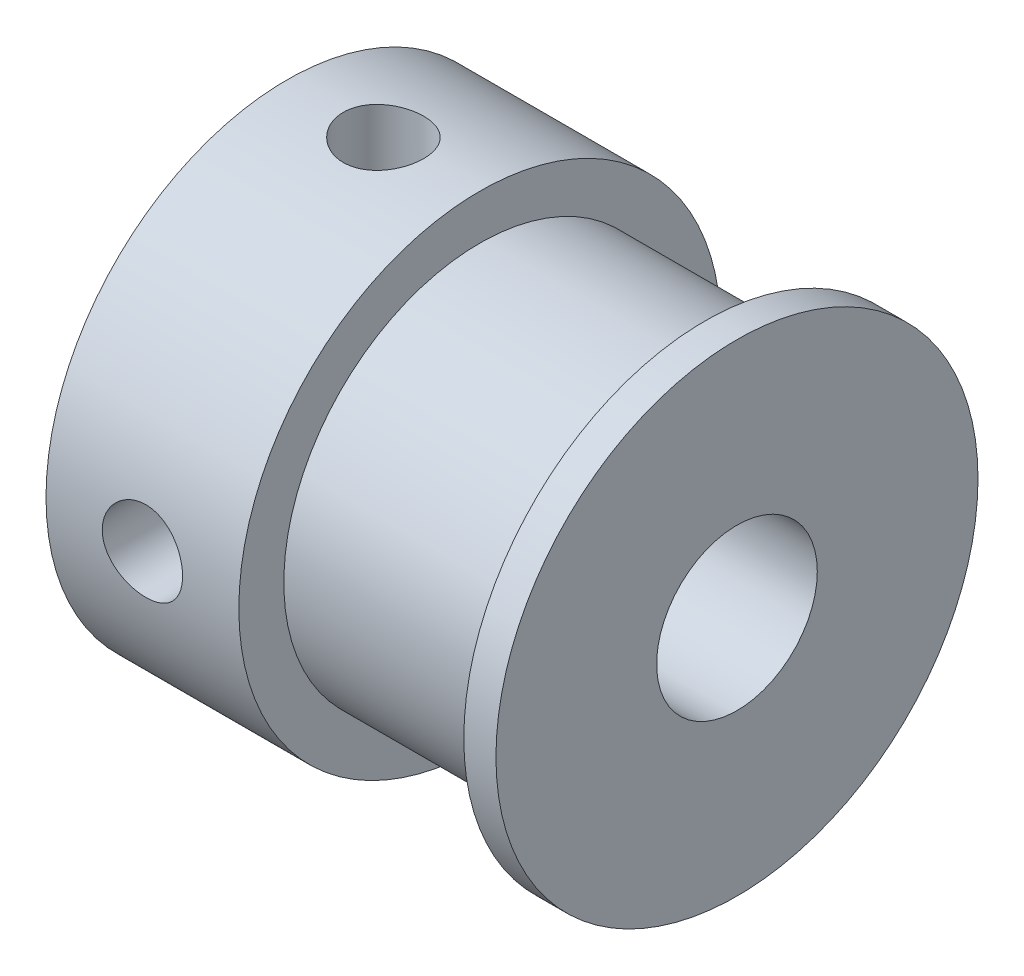
ISO-10303-21;
HEADER;
FILE_DESCRIPTION(('STEP AP214'),'2;1');
FILE_NAME('part.step','',(''),(''),'','','');
FILE_SCHEMA(('AUTOMOTIVE_DESIGN { 1 0 10303 214 1 1 1 1 }'));
ENDSEC;
DATA;
#1=APPLICATION_CONTEXT('core data for automotive mechanical design processes');
#2=APPLICATION_PROTOCOL_DEFINITION('international standard','automotive_design',2000,#1);
#3=PRODUCT_CONTEXT('',#1,'mechanical');
#4=PRODUCT('Part','Part','',(#3));
#5=PRODUCT_RELATED_PRODUCT_CATEGORY('part','',(#4));
#6=PRODUCT_DEFINITION_FORMATION('','',#4);
#7=PRODUCT_DEFINITION_CONTEXT('part definition',#1,'design');
#8=PRODUCT_DEFINITION('design','',#6,#7);
#9=PRODUCT_DEFINITION_SHAPE('','',#8);
#10=(LENGTH_UNIT() NAMED_UNIT(*) SI_UNIT(.MILLI.,.METRE.));
#11=(NAMED_UNIT(*) PLANE_ANGLE_UNIT() SI_UNIT($,.RADIAN.));
#12=(NAMED_UNIT(*) SI_UNIT($,.STERADIAN.) SOLID_ANGLE_UNIT());
#13=UNCERTAINTY_MEASURE_WITH_UNIT(LENGTH_MEASURE(1.E-05),#10,'distance_accuracy_value','');
#14=(GEOMETRIC_REPRESENTATION_CONTEXT(3) GLOBAL_UNCERTAINTY_ASSIGNED_CONTEXT((#13)) GLOBAL_UNIT_ASSIGNED_CONTEXT((#10,
#11,#12)) REPRESENTATION_CONTEXT('',''));
#15=CARTESIAN_POINT('',(0.,0.,0.));
#16=DIRECTION('',(0.,0.,1.));
#17=DIRECTION('',(1.,0.,0.));
#18=AXIS2_PLACEMENT_3D('',#15,#16,#17);
#19=CARTESIAN_POINT('',(0.,0.,0.));
#20=DIRECTION('',(1.,0.,0.));
#21=DIRECTION('',(0.,0.,-1.));
#22=AXIS2_PLACEMENT_3D('',#19,#20,#21);
#23=CYLINDRICAL_SURFACE('',#22,2.5);
#24=CARTESIAN_POINT('',(1.75000000000001,0.,2.5));
#25=CARTESIAN_POINT('',(1.75000412789938,0.0657149536912327,2.49999641755189));
#26=CARTESIAN_POINT('',(1.7552125914021,0.13150824962254,2.49738113774397));
#27=CARTESIAN_POINT('',(1.77581610042615,0.26115029408553,2.48717695046745));
#28=CARTESIAN_POINT('',(1.79123049124707,0.324995108391878,2.4795785978623));
#29=CARTESIAN_POINT('',(1.831492260771,0.448666931100716,2.4602034925414));
#30=CARTESIAN_POINT('',(1.85630298031002,0.508508503673972,2.448442989719));
#31=CARTESIAN_POINT('',(1.91446327670618,0.623090771008203,2.42182220644723));
#32=CARTESIAN_POINT('',(1.94781218031107,0.677831867487559,2.40696217041913));
#33=CARTESIAN_POINT('',(2.02439656185663,0.784384772202394,2.37445322822571));
#34=CARTESIAN_POINT('',(2.06810809904956,0.835819013902635,2.3566899890942));
#35=CARTESIAN_POINT('',(2.1631518490588,0.930974306083716,2.32074962808431));
#36=CARTESIAN_POINT('',(2.21448981471555,0.974689478883452,2.30257220261294));
#37=CARTESIAN_POINT('',(2.32810418690423,1.05656500056284,2.26623688996684));
#38=CARTESIAN_POINT('',(2.39092012293239,1.09403166943954,2.24818983712665));
#39=CARTESIAN_POINT('',(2.52295916998277,1.15771028361336,2.21607473465401));
#40=CARTESIAN_POINT('',(2.59217766090344,1.18393026870791,2.20200384508737));
#41=CARTESIAN_POINT('',(2.73083138177741,1.22266555273573,2.18072333797261));
#42=CARTESIAN_POINT('',(2.80000556508424,1.23590732135054,2.17315339479642));
#43=CARTESIAN_POINT('',(2.93997354722435,1.25053374163605,2.1647736243566));
#44=CARTESIAN_POINT('',(3.01076567608894,1.25193011046634,2.16395711679111));
#45=CARTESIAN_POINT('',(3.14285753039421,1.24335910896536,2.16888662821561));
#46=CARTESIAN_POINT('',(3.20428003902881,1.23473069942102,2.17385954577517));
#47=CARTESIAN_POINT('',(3.3246523867163,1.20867481132116,2.18845285917313));
#48=CARTESIAN_POINT('',(3.38360143163164,1.19124452987206,2.19807473539721));
#49=CARTESIAN_POINT('',(3.49903641570707,1.1477622254825,2.22109345515927));
#50=CARTESIAN_POINT('',(3.55543299848223,1.12151883389499,2.23457300829999));
#51=CARTESIAN_POINT('',(3.66329286573751,1.061302109585,2.26379255351755));
#52=CARTESIAN_POINT('',(3.71475391950011,1.02732530476558,2.27953355975239));
#53=CARTESIAN_POINT('',(3.81815156592903,0.94758256864098,2.31391447379108));
#54=CARTESIAN_POINT('',(3.86932109197019,0.900868072961596,2.33266887795933));
#55=CARTESIAN_POINT('',(3.96341927323862,0.799444473426712,2.36934529125509));
#56=CARTESIAN_POINT('',(4.00634399004235,0.744731570717852,2.38726689948501));
#57=CARTESIAN_POINT('',(4.08460707628715,0.625645632289807,2.42127484103705));
#58=CARTESIAN_POINT('',(4.11950059055717,0.560941989499257,2.43723730202509));
#59=CARTESIAN_POINT('',(4.17762128630375,0.425582769360993,2.46447351401553));
#60=CARTESIAN_POINT('',(4.20085773126895,0.354931970331593,2.47575098679441));
#61=CARTESIAN_POINT('',(4.23309425464584,0.215958114575875,2.49155417176795));
#62=CARTESIAN_POINT('',(4.24311404468347,0.147926913185404,2.4965617287664));
#63=CARTESIAN_POINT('',(4.2518309139181,0.0109744999366913,2.50091266823877));
#64=CARTESIAN_POINT('',(4.25053335704934,-0.057946274837377,2.5002587340164));
#65=CARTESIAN_POINT('',(4.23724163947655,-0.189041214982492,2.49363990316801));
#66=CARTESIAN_POINT('',(4.22608433408745,-0.251324260062442,2.48809057110237));
#67=CARTESIAN_POINT('',(4.19470241013114,-0.373008615377395,2.47277714143524));
#68=CARTESIAN_POINT('',(4.1744767919333,-0.432409607113745,2.46301257917916));
#69=CARTESIAN_POINT('',(4.12500191695853,-0.548610760562079,2.43980314267087));
#70=CARTESIAN_POINT('',(4.09551118735398,-0.605287996257689,2.42626102212424));
#71=CARTESIAN_POINT('',(4.02861558044244,-0.713076702123648,2.39679967896386));
#72=CARTESIAN_POINT('',(3.9912073317582,-0.764185787219099,2.38087944457232));
#73=CARTESIAN_POINT('',(3.9052994683339,-0.864709611613313,2.34635276671831));
#74=CARTESIAN_POINT('',(3.85607141443304,-0.913465097280795,2.32763606060552));
#75=CARTESIAN_POINT('',(3.75009356091336,-1.00232040139154,2.29077989504843));
#76=CARTESIAN_POINT('',(3.69333860147953,-1.04241423211355,2.27264084226908));
#77=CARTESIAN_POINT('',(3.57044543224961,-1.11463489312211,2.23813990282585));
#78=CARTESIAN_POINT('',(3.50398591723925,-1.14628186984829,2.2219066207934));
#79=CARTESIAN_POINT('',(3.36561241538434,-1.19760353251725,2.19467590460158));
#80=CARTESIAN_POINT('',(3.29370559187351,-1.21729364485946,2.18367172800773));
#81=CARTESIAN_POINT('',(3.15386222142319,-1.24232710931209,2.16951876260834));
#82=CARTESIAN_POINT('',(3.0862071832137,-1.24886624550107,2.16571729325614));
#83=CARTESIAN_POINT('',(2.95069116603659,-1.25086144297598,2.16456693307719));
#84=CARTESIAN_POINT('',(2.88283028907571,-1.24632230828049,2.16721524534441));
#85=CARTESIAN_POINT('',(2.75564562308498,-1.22740765699032,2.17797327562531));
#86=CARTESIAN_POINT('',(2.6961244123195,-1.21401039292849,2.18553868102992));
#87=CARTESIAN_POINT('',(2.58023985071912,-1.1789691977808,2.20463770234897));
#88=CARTESIAN_POINT('',(2.52387752238504,-1.15732261394975,2.21617259462095));
#89=CARTESIAN_POINT('',(2.41171893626674,-1.10476968162585,2.2428566295566));
#90=CARTESIAN_POINT('',(2.35621512271288,-1.07333892227057,2.25819652995239));
#91=CARTESIAN_POINT('',(2.25090682977427,-1.00268871454579,2.29044164543238));
#92=CARTESIAN_POINT('',(2.20110533685189,-0.963465214048303,2.30734767243153));
#93=CARTESIAN_POINT('',(2.10232252205298,-0.872754158330795,2.34327903949142));
#94=CARTESIAN_POINT('',(2.0541761220476,-0.820355528762707,2.36231229139336));
#95=CARTESIAN_POINT('',(1.96717127072046,-0.707693507775343,2.3984719031886));
#96=CARTESIAN_POINT('',(1.92831782571714,-0.647425904070975,2.4155972326005));
#97=CARTESIAN_POINT('',(1.86095454654725,-0.519914496024928,2.44622511981379));
#98=CARTESIAN_POINT('',(1.83251978823571,-0.452624379918263,2.45970120703636));
#99=CARTESIAN_POINT('',(1.78773979010132,-0.313427626617735,2.48126676704332));
#100=CARTESIAN_POINT('',(1.77136019146303,-0.241534749528953,2.48937154216165));
#101=CARTESIAN_POINT('',(1.7576282361552,-0.140752433104227,2.49619327387079));
#102=CARTESIAN_POINT('',(1.75477169892048,-0.112702349299371,2.49761706674002));
#103=CARTESIAN_POINT('',(1.750956668104,-0.0564396647589458,2.49952121222331));
#104=CARTESIAN_POINT('',(1.74999822691101,-0.0282270595592261,2.50000153879704));
#105=CARTESIAN_POINT('',(1.75000000000001,0.,2.5));
#106=B_SPLINE_CURVE_WITH_KNOTS('',3,(#24,#25,#26,#27,#28,#29,#30,#31,#32,#33,#34,#35,#36,#37,
#38,#39,#40,#41,#42,#43,#44,#45,#46,#47,#48,#49,#50,#51,#52,#53,#54,#55,#56,#57,#58,#59,#60,#61,
#62,#63,#64,#65,#66,#67,#68,#69,#70,#71,#72,#73,#74,#75,#76,#77,#78,#79,#80,#81,#82,#83,#84,#85,
#86,#87,#88,#89,#90,#91,#92,#93,#94,#95,#96,#97,#98,#99,#100,#101,#102,#103,#104,#105),
.UNSPECIFIED.,.T.,.F.,(4,2,2,2,2,2,2,2,2,2,2,2,2,2,2,2,2,2,2,2,2,2,2,2,2,2,2,2,2,2,2,2,2,2,2,2,
2,2,2,2,4),(0.,0.197030321775364,0.394435187136495,0.59107769436537,0.787704700726955,
0.996227198397605,1.20490779706754,1.4297715803844,1.6544743487285,1.86572515175286,
2.07676696661274,2.26257140511649,2.44843504907097,2.63862800210608,2.82890651575276,
3.04331176667346,3.25781918248356,3.48228777768049,3.70657771140347,3.9122911308918,
4.11790705639343,4.3075863313265,4.49728652038662,4.69241070034871,4.88761813435421,
5.10199513305521,5.31651985769287,5.54143352699589,5.76605639925969,5.96911634372963,
6.17208824825003,6.35572412805225,6.53941910979594,6.73545570969514,6.93159451423693,
7.15156553440619,7.37165479220712,7.59330017078652,7.81431135781158,7.89894100172117,
7.98357298143554),.UNSPECIFIED.);
#107=CARTESIAN_POINT('',(1.75000000000001,0.,2.5));
#108=VERTEX_POINT('',#107);
#109=EDGE_CURVE('E81',#108,#108,#106,.T.);
#110=ORIENTED_EDGE('',*,*,#109,.F.);
#111=EDGE_LOOP('',(#110));
#112=FACE_BOUND('',#111,.T.);
#113=CARTESIAN_POINT('',(3.,2.1650635094611,-1.25));
#114=CARTESIAN_POINT('',(3.06513476024406,2.16506918410574,-1.24999545384316));
#115=CARTESIAN_POINT('',(3.13035176440631,2.16804751484696,-1.24487496341652));
#116=CARTESIAN_POINT('',(3.25878408084644,2.17952958065066,-1.22465401237257));
#117=CARTESIAN_POINT('',(3.32199489380426,2.18804492569449,-1.20953258069272));
#118=CARTESIAN_POINT('',(3.44431458042993,2.20936683256748,-1.17012493587476));
#119=CARTESIAN_POINT('',(3.50344331559198,2.22215054341565,-1.14588744061716));
#120=CARTESIAN_POINT('',(3.6167802524959,2.25053331021072,-1.08908440672046));
#121=CARTESIAN_POINT('',(3.67098818782807,2.26613251845081,-1.05651841754472));
#122=CARTESIAN_POINT('',(3.77788216069688,2.29996086321802,-0.980833175663598));
#123=CARTESIAN_POINT('',(3.83007391959193,2.31830079547442,-0.937065045179713));
#124=CARTESIAN_POINT('',(3.92676048550839,2.35464978482132,-0.841567259518085));
#125=CARTESIAN_POINT('',(3.9712514532294,2.37265867289062,-0.789833657227866));
#126=CARTESIAN_POINT('',(4.05420893893458,2.40776846191186,-0.675611954268182));
#127=CARTESIAN_POINT('',(4.09206720982441,2.42472633022716,-0.612633986265718));
#128=CARTESIAN_POINT('',(4.1564260665572,2.45438445124411,-0.48019628324938));
#129=CARTESIAN_POINT('',(4.18293382017146,2.46708738979677,-0.410740672672694));
#130=CARTESIAN_POINT('',(4.22188082662637,2.48600576555297,-0.272556179907471));
#131=CARTESIAN_POINT('',(4.23518690794442,2.49261850276115,-0.204127238111022));
#132=CARTESIAN_POINT('',(4.2502076483438,2.50009479807584,-0.0657132858723104));
#133=CARTESIAN_POINT('',(4.25192932099464,2.50096183480737,0.00427075730467264));
#134=CARTESIAN_POINT('',(4.24406665753706,2.49703727395563,0.137290655529687));
#135=CARTESIAN_POINT('',(4.23545248059847,2.49273119865201,0.200401498970989));
#136=CARTESIAN_POINT('',(4.20889894511918,2.47967806574684,0.324142214897902));
#137=CARTESIAN_POINT('',(4.19095888877972,2.47093067582992,0.384771901367406));
#138=CARTESIAN_POINT('',(4.14614679238773,2.44964479109568,0.502886739461942));
#139=CARTESIAN_POINT('',(4.11915460853491,2.43705551911499,0.560316779393972));
#140=CARTESIAN_POINT('',(4.05717072974813,2.40922057483359,0.66997100189166));
#141=CARTESIAN_POINT('',(4.02217617087206,2.39397395196855,0.722193311048307));
#142=CARTESIAN_POINT('',(3.94138081058373,2.36055492999037,0.825217076122743));
#143=CARTESIAN_POINT('',(3.89487121459249,2.34224219997719,0.8754175937867));
#144=CARTESIAN_POINT('',(3.79426284383728,2.30567925733515,0.967630462872225));
#145=CARTESIAN_POINT('',(3.74015828465742,2.28742910332036,1.00963651446779));
#146=CARTESIAN_POINT('',(3.62168975946989,2.25180195115606,1.08688166830276));
#147=CARTESIAN_POINT('',(3.55689247118223,2.23455399988385,1.12152164372256));
#148=CARTESIAN_POINT('',(3.42132791080125,2.2046931284822,1.17914889125154));
#149=CARTESIAN_POINT('',(3.35056695872805,2.19207537557584,1.20214832276361));
#150=CARTESIAN_POINT('',(3.21098186089651,2.17430794771293,1.2339752637813));
#151=CARTESIAN_POINT('',(3.14244860119556,2.16864569810621,1.24378140264997));
#152=CARTESIAN_POINT('',(3.00449832310432,2.16397399202012,1.25189618326428));
#153=CARTESIAN_POINT('',(2.93508196360027,2.1649598361164,1.25021294664378));
#154=CARTESIAN_POINT('',(2.80543260177659,2.17292920675731,1.23629505417996));
#155=CARTESIAN_POINT('',(2.74502568611509,2.17924484383318,1.22523477089058));
#156=CARTESIAN_POINT('',(2.6270402671613,2.19617526939176,1.19462035579055));
#157=CARTESIAN_POINT('',(2.56946268656674,2.20679145006292,1.17506347327952));
#158=CARTESIAN_POINT('',(2.45573583637163,2.23170277599571,1.12705948575611));
#159=CARTESIAN_POINT('',(2.39977622893306,2.24614554053829,1.0982425796159));
#160=CARTESIAN_POINT('',(2.29316341057626,2.27695149371562,1.03285883001975));
#161=CARTESIAN_POINT('',(2.2425129456084,2.29331566693935,0.99628800541527));
#162=CARTESIAN_POINT('',(2.14127654059557,2.3285999807042,0.911046458998566));
#163=CARTESIAN_POINT('',(2.09150356160293,2.34758228942861,0.861431590393708));
#164=CARTESIAN_POINT('',(2.00073470250801,2.38417793722366,0.75425561924786));
#165=CARTESIAN_POINT('',(1.95974178721183,2.40179081259637,0.696691843319183));
#166=CARTESIAN_POINT('',(1.88678284256237,2.43426702113696,0.573169203198446));
#167=CARTESIAN_POINT('',(1.85508360223636,2.44904552090037,0.507028871967641));
#168=CARTESIAN_POINT('',(1.80357762017826,2.47354193699126,0.369402955801352));
#169=CARTESIAN_POINT('',(1.78376043579212,2.48326429595466,0.29792212674022));
#170=CARTESIAN_POINT('',(1.75828929478167,2.49584385227353,0.158724602913021));
#171=CARTESIAN_POINT('',(1.75150265515486,2.49924909885239,0.0912643048130715));
#172=CARTESIAN_POINT('',(1.748945918182,2.50052662968914,-0.0439074824390041));
#173=CARTESIAN_POINT('',(1.75317196434555,2.49840085083612,-0.111618875368858));
#174=CARTESIAN_POINT('',(1.77177050849453,2.48917461047403,-0.240672490396433));
#175=CARTESIAN_POINT('',(1.78545606157209,2.48241118334987,-0.302140397264079));
#176=CARTESIAN_POINT('',(1.82165874912871,2.46490117079279,-0.421807440229521));
#177=CARTESIAN_POINT('',(1.84417715011682,2.45415401415995,-0.480006106194385));
#178=CARTESIAN_POINT('',(1.89840881520747,2.4290741343515,-0.594279257806105));
#179=CARTESIAN_POINT('',(1.9304741540098,2.41460771498499,-0.650156428375057));
#180=CARTESIAN_POINT('',(2.00244741357381,2.38360166427283,-0.75596830226753));
#181=CARTESIAN_POINT('',(2.04235893639459,2.36706108197951,-0.805900259268633));
#182=CARTESIAN_POINT('',(2.13349642377838,2.33160762783285,-0.903642505196113));
#183=CARTESIAN_POINT('',(2.18545310934649,2.31262248764622,-0.950747105674089));
#184=CARTESIAN_POINT('',(2.29681340141221,2.27578845203566,-1.03582910924334));
#185=CARTESIAN_POINT('',(2.35622352608461,2.25794057202332,-1.07379843751257));
#186=CARTESIAN_POINT('',(2.48329580822619,2.22499506631145,-1.14053884973207));
#187=CARTESIAN_POINT('',(2.55115941391092,2.21000217820338,-1.16898133245117));
#188=CARTESIAN_POINT('',(2.69166550542472,2.1858269541044,-1.21359838688301));
#189=CARTESIAN_POINT('',(2.76429111114086,2.17662520184628,-1.22981398896918));
#190=CARTESIAN_POINT('',(2.864756694565,2.16911590752238,-1.24295875983052));
#191=CARTESIAN_POINT('',(2.89170986799735,2.1676016125644,-1.24559513120481));
#192=CARTESIAN_POINT('',(2.9457706008528,2.16557419859688,-1.24911675636245));
#193=CARTESIAN_POINT('',(2.97287817048234,2.16506114656387,-1.25000189299984));
#194=CARTESIAN_POINT('',(3.,2.1650635094611,-1.25));
#195=B_SPLINE_CURVE_WITH_KNOTS('',3,(#113,#114,#115,#116,#117,#118,#119,#120,#121,#122,#123,
#124,#125,#126,#127,#128,#129,#130,#131,#132,#133,#134,#135,#136,#137,#138,#139,#140,#141,#142,
#143,#144,#145,#146,#147,#148,#149,#150,#151,#152,#153,#154,#155,#156,#157,#158,#159,#160,#161,
#162,#163,#164,#165,#166,#167,#168,#169,#170,#171,#172,#173,#174,#175,#176,#177,#178,#179,#180,
#181,#182,#183,#184,#185,#186,#187,#188,#189,#190,#191,#192,#193,#194),.UNSPECIFIED.,.T.,.F.,(4,
2,2,2,2,2,2,2,2,2,2,2,2,2,2,2,2,2,2,2,2,2,2,2,2,2,2,2,2,2,2,2,2,2,2,2,2,2,2,2,4),(0.,
0.195290153243394,0.390991116031005,0.585660744898606,0.780340906806436,0.99107789062279,
1.20191963855464,1.42697365298454,1.65188533704864,1.86079356209919,2.0695752960755,
2.26020121855673,2.45084140646819,2.64411918413933,2.8374662418784,3.04908989321113,
3.26087560307398,3.4861105216181,3.71110967764631,3.91827863567764,4.12530116485466,
4.30967729280032,4.49411315545078,4.68709120507609,4.88016857775059,5.09758429475766,
5.31507331222752,5.53830226766207,5.76133474760964,5.96390337986858,6.16640108492464,
6.35555531089365,6.54473666890016,6.74200938399339,6.93937287625898,7.15637802312584,
7.37357428556442,7.59763436298256,7.8209391625345,7.90225168981636,7.98356965618175),.UNSPECIFIED.);
#196=CARTESIAN_POINT('',(3.,2.1650635094611,-1.25));
#197=VERTEX_POINT('',#196);
#198=EDGE_CURVE('E73',#197,#197,#195,.T.);
#199=ORIENTED_EDGE('',*,*,#198,.F.);
#200=EDGE_LOOP('',(#199));
#201=FACE_BOUND('',#200,.T.);
#202=CARTESIAN_POINT('',(14.,0.,0.));
#203=DIRECTION('',(1.,0.,0.));
#204=DIRECTION('',(0.,0.,-1.));
#205=AXIS2_PLACEMENT_3D('',#202,#203,#204);
#206=CIRCLE('',#205,2.5);
#207=CARTESIAN_POINT('',(14.,0.,-2.5));
#208=VERTEX_POINT('',#207);
#209=EDGE_CURVE('E80',#208,#208,#206,.T.);
#210=ORIENTED_EDGE('',*,*,#209,.T.);
#211=EDGE_LOOP('',(#210));
#212=FACE_BOUND('',#211,.T.);
#213=CARTESIAN_POINT('',(0.,0.,0.));
#214=DIRECTION('',(1.,0.,0.));
#215=DIRECTION('',(0.,0.,-1.));
#216=AXIS2_PLACEMENT_3D('',#213,#214,#215);
#217=CIRCLE('',#216,2.5);
#218=CARTESIAN_POINT('',(0.,0.,-2.5));
#219=VERTEX_POINT('',#218);
#220=EDGE_CURVE('E48',#219,#219,#217,.T.);
#221=ORIENTED_EDGE('',*,*,#220,.F.);
#222=EDGE_LOOP('',(#221));
#223=FACE_BOUND('',#222,.T.);
#224=ADVANCED_FACE('F32',(#112,#201,#212,#223),#23,.F.);
#225=CARTESIAN_POINT('',(0.,2.5,0.));
#226=DIRECTION('',(-1.,0.,0.));
#227=DIRECTION('',(0.,0.,1.));
#228=AXIS2_PLACEMENT_3D('',#225,#226,#227);
#229=PLANE('',#228);
#230=ORIENTED_EDGE('',*,*,#220,.T.);
#231=EDGE_LOOP('',(#230));
#232=FACE_BOUND('',#231,.T.);
#233=CARTESIAN_POINT('',(0.,0.,0.));
#234=DIRECTION('',(1.,0.,0.));
#235=DIRECTION('',(0.,0.,-1.));
#236=AXIS2_PLACEMENT_3D('',#233,#234,#235);
#237=CIRCLE('',#236,7.5);
#238=CARTESIAN_POINT('',(0.,0.,-7.5));
#239=VERTEX_POINT('',#238);
#240=EDGE_CURVE('E52',#239,#239,#237,.T.);
#241=ORIENTED_EDGE('',*,*,#240,.F.);
#242=EDGE_LOOP('',(#241));
#243=FACE_BOUND('',#242,.T.);
#244=ADVANCED_FACE('F106',(#232,#243),#229,.T.);
#245=CARTESIAN_POINT('',(0.,0.,0.));
#246=DIRECTION('',(1.,0.,0.));
#247=DIRECTION('',(0.,0.,-1.));
#248=AXIS2_PLACEMENT_3D('',#245,#246,#247);
#249=CYLINDRICAL_SURFACE('',#248,7.5);
#250=CARTESIAN_POINT('',(1.75000000000001,0.,7.5));
#251=CARTESIAN_POINT('',(1.75000279447392,-0.069695452479107,7.49999880584412));
#252=CARTESIAN_POINT('',(1.75584863748447,-0.13942894091941,7.49901838956517));
#253=CARTESIAN_POINT('',(1.77906782938267,-0.27694011083652,7.49520172470694));
#254=CARTESIAN_POINT('',(1.79645177845581,-0.344715933979622,7.49236376961945));
#255=CARTESIAN_POINT('',(1.84220772429638,-0.476302373606319,7.48515034118225));
#256=CARTESIAN_POINT('',(1.87057073282029,-0.540116184215947,7.48077612579597));
#257=CARTESIAN_POINT('',(1.9374561460262,-0.662070920988969,7.47097113541035));
#258=CARTESIAN_POINT('',(1.9759773887415,-0.720212494939292,7.46554048127217));
#259=CARTESIAN_POINT('',(2.06247754191024,-0.829736307145835,7.45416658729157));
#260=CARTESIAN_POINT('',(2.11053455731807,-0.881056451767479,7.44821935907428));
#261=CARTESIAN_POINT('',(2.21457398423641,-0.974944249329958,7.43651313438366));
#262=CARTESIAN_POINT('',(2.27055689572831,-1.01751134969548,7.43075414981334));
#263=CARTESIAN_POINT('',(2.38928548309853,-1.09293356280256,7.4200378287989));
#264=CARTESIAN_POINT('',(2.45207066840238,-1.12572727643049,7.41508564545818));
#265=CARTESIAN_POINT('',(2.58235478215032,-1.1802791827056,7.40659894897337));
#266=CARTESIAN_POINT('',(2.64985339183882,-1.2020381207828,7.40306434007154));
#267=CARTESIAN_POINT('',(2.78699013742827,-1.2337071888924,7.39785268421378));
#268=CARTESIAN_POINT('',(2.8566028682507,-1.24372451456769,7.3961588424285));
#269=CARTESIAN_POINT('',(2.99654013844174,-1.25195836264493,7.39476969468325));
#270=CARTESIAN_POINT('',(3.06686462708365,-1.25017572019449,7.39507424728607));
#271=CARTESIAN_POINT('',(3.20546393063772,-1.23494754919807,7.39763214431778));
#272=CARTESIAN_POINT('',(3.27375240177262,-1.22162244094488,7.39986536659458));
#273=CARTESIAN_POINT('',(3.40711065891456,-1.18387657020172,7.40599747605504));
#274=CARTESIAN_POINT('',(3.47218033444427,-1.15945542715986,7.40989642036636));
#275=CARTESIAN_POINT('',(3.59761441172046,-1.10008862304695,7.4189423966705));
#276=CARTESIAN_POINT('',(3.65795470304061,-1.06509295693985,7.42409533553663));
#277=CARTESIAN_POINT('',(3.77195220026919,-0.985606008778711,7.43506459207505));
#278=CARTESIAN_POINT('',(3.82560886622746,-0.941113960327138,7.44088096327143));
#279=CARTESIAN_POINT('',(3.92541304290367,-0.843241106079522,7.45261013939893));
#280=CARTESIAN_POINT('',(3.97145925927004,-0.789756981936559,7.45852324615826));
#281=CARTESIAN_POINT('',(4.05393888133267,-0.675767624490819,7.46971300698362));
#282=CARTESIAN_POINT('',(4.09037222509161,-0.615262345953207,7.47498965694873));
#283=CARTESIAN_POINT('',(4.15260111356814,-0.488852958083352,7.48431946446456));
#284=CARTESIAN_POINT('',(4.17838770966562,-0.422944362782327,7.48837159203724));
#285=CARTESIAN_POINT('',(4.21849710762298,-0.287649172801363,7.4947875150633));
#286=CARTESIAN_POINT('',(4.23282086848685,-0.218262869589732,7.49715145175237));
#287=CARTESIAN_POINT('',(4.24946067923056,-0.0788549506508106,7.49990564921343));
#288=CARTESIAN_POINT('',(4.2519157859028,-0.0088503685755048,7.50031876506392));
#289=CARTESIAN_POINT('',(4.24511932778593,0.130569886444944,7.49918737210585));
#290=CARTESIAN_POINT('',(4.23586821343312,0.199985581946019,7.49764293862059));
#291=CARTESIAN_POINT('',(4.20603757533225,0.33582808777338,7.49278413469101));
#292=CARTESIAN_POINT('',(4.18552689580493,0.402270434192688,7.48948052400655));
#293=CARTESIAN_POINT('',(4.13383274090023,0.530773442430219,7.48147232227679));
#294=CARTESIAN_POINT('',(4.10264866618236,0.592833857954856,7.4767676525601));
#295=CARTESIAN_POINT('',(4.0301744376516,0.711415344734475,7.46642258151204));
#296=CARTESIAN_POINT('',(3.98879742191637,0.76788262546857,7.46077427943511));
#297=CARTESIAN_POINT('',(3.89723134230746,0.873121792751339,7.4491923369595));
#298=CARTESIAN_POINT('',(3.84704163836166,0.921893119848286,7.44325867585773));
#299=CARTESIAN_POINT('',(3.73865122596428,1.01087138982899,7.43170087617923));
#300=CARTESIAN_POINT('',(3.68037291724279,1.05098438055685,7.42608058068553));
#301=CARTESIAN_POINT('',(3.55782351543073,1.12085115514749,7.41585764888942));
#302=CARTESIAN_POINT('',(3.49355261238625,1.1506052673849,7.4112549803301));
#303=CARTESIAN_POINT('',(3.36110513359393,1.19876916573657,7.40361726848852));
#304=CARTESIAN_POINT('',(3.29294595248475,1.21722571627397,7.40057577155532));
#305=CARTESIAN_POINT('',(3.15443993538912,1.24241772688913,7.3963885841763));
#306=CARTESIAN_POINT('',(3.08409329013397,1.24915420597308,7.39524272891361));
#307=CARTESIAN_POINT('',(2.9441474170188,1.25068643302367,7.39498366542006));
#308=CARTESIAN_POINT('',(2.87454981071236,1.24563006806259,7.39584528252825));
#309=CARTESIAN_POINT('',(2.73721037597462,1.22403991947842,7.39944890726864));
#310=CARTESIAN_POINT('',(2.66946854152907,1.20750617305623,7.40219090880607));
#311=CARTESIAN_POINT('',(2.5378207813537,1.16348724479744,7.40923678140859));
#312=CARTESIAN_POINT('',(2.47391049497199,1.13601479530021,7.41353883609835));
#313=CARTESIAN_POINT('',(2.35158216540258,1.07091350195795,7.42322184461104));
#314=CARTESIAN_POINT('',(2.29316439481394,1.03328415437427,7.428602851942));
#315=CARTESIAN_POINT('',(2.18273220844613,0.948409442186072,7.43991727022811));
#316=CARTESIAN_POINT('',(2.13080199164987,0.901055281796818,7.44585647788151));
#317=CARTESIAN_POINT('',(2.03557419776254,0.79830451569011,7.45757186180421));
#318=CARTESIAN_POINT('',(1.99227861568092,0.742906056456313,7.46334800013273));
#319=CARTESIAN_POINT('',(1.91527586590003,0.625184584820136,7.4741326482111));
#320=CARTESIAN_POINT('',(1.88163698034353,0.562816393766405,7.47913558126552));
#321=CARTESIAN_POINT('',(1.82536525769505,0.433256534689487,7.48775583800888));
#322=CARTESIAN_POINT('',(1.80272145946016,0.366069747415002,7.49137454088741));
#323=CARTESIAN_POINT('',(1.77399736293667,0.248851655022698,7.49602895416478));
#324=CARTESIAN_POINT('',(1.76501276519202,0.199529415149222,7.49751013636679));
#325=CARTESIAN_POINT('',(1.75301313107763,0.100144655159903,7.4994960799306));
#326=CARTESIAN_POINT('',(1.74999799193133,0.0500821478042465,7.50000085810321));
#327=CARTESIAN_POINT('',(1.75000000000001,0.,7.5));
#328=B_SPLINE_CURVE_WITH_KNOTS('',3,(#250,#251,#252,#253,#254,#255,#256,#257,#258,#259,#260,
#261,#262,#263,#264,#265,#266,#267,#268,#269,#270,#271,#272,#273,#274,#275,#276,#277,#278,#279,
#280,#281,#282,#283,#284,#285,#286,#287,#288,#289,#290,#291,#292,#293,#294,#295,#296,#297,#298,
#299,#300,#301,#302,#303,#304,#305,#306,#307,#308,#309,#310,#311,#312,#313,#314,#315,#316,#317,
#318,#319,#320,#321,#322,#323,#324,#325,#326,#327),.UNSPECIFIED.,.T.,.F.,(4,2,2,2,2,2,2,2,2,2,2,
2,2,2,2,2,2,2,2,2,2,2,2,2,2,2,2,2,2,2,2,2,2,2,2,2,2,2,4),(0.,0.208903292469254,
0.417998772847708,0.626923433512632,0.835824206337391,1.04651245531165,1.25721400084928,
1.46921260411919,1.6811968843809,1.89123038551711,2.10124902160442,2.30910260880203,
2.51696332512689,2.72582278316277,2.93469910340285,3.14616384955662,3.35762995817922,
3.5692734445795,3.78089922260572,3.99003941745696,4.19917156517927,4.40703903503205,
4.61491817913031,4.82463412813509,5.03436531527139,5.24626911003807,5.45816618687968,
5.66918011170883,5.88017568893306,6.08853954761347,6.29690273094063,6.50502409113108,
6.71315577514664,6.92375692096692,7.13440666939482,7.34651115803596,7.55840376065032,
7.70852124082005,7.85863613638479),.UNSPECIFIED.);
#329=CARTESIAN_POINT('',(1.75000000000001,0.,7.5));
#330=VERTEX_POINT('',#329);
#331=EDGE_CURVE('E10',#330,#330,#328,.T.);
#332=ORIENTED_EDGE('',*,*,#331,.F.);
#333=EDGE_LOOP('',(#332));
#334=FACE_BOUND('',#333,.T.);
#335=CARTESIAN_POINT('',(4.25,7.5,0.));
#336=CARTESIAN_POINT('',(4.24999720552609,7.49999880584412,-0.0696954524791073));
#337=CARTESIAN_POINT('',(4.24415136251554,7.49901838956517,-0.13942894091941));
#338=CARTESIAN_POINT('',(4.22093217061734,7.49520172470694,-0.276940110836521));
#339=CARTESIAN_POINT('',(4.2035482215442,7.49236376961945,-0.344715933979623));
#340=CARTESIAN_POINT('',(4.15779227570362,7.48515034118225,-0.476302373606321));
#341=CARTESIAN_POINT('',(4.12942926717971,7.48077612579596,-0.54011618421595));
#342=CARTESIAN_POINT('',(4.0625438539738,7.47097113541035,-0.662070920988972));
#343=CARTESIAN_POINT('',(4.0240226112585,7.46554048127217,-0.720212494939295));
#344=CARTESIAN_POINT('',(3.93752245808977,7.45416658729156,-0.829736307145839));
#345=CARTESIAN_POINT('',(3.88946544268193,7.44821935907428,-0.881056451767483));
#346=CARTESIAN_POINT('',(3.78542601576359,7.43651313438366,-0.974944249329963));
#347=CARTESIAN_POINT('',(3.72944310427169,7.43075414981334,-1.01751134969548));
#348=CARTESIAN_POINT('',(3.61071451690147,7.4200378287989,-1.09293356280257));
#349=CARTESIAN_POINT('',(3.54792933159762,7.41508564545818,-1.1257272764305));
#350=CARTESIAN_POINT('',(3.41764521784969,7.40659894897337,-1.18027918270561));
#351=CARTESIAN_POINT('',(3.35014660816118,7.40306434007154,-1.20203812078281));
#352=CARTESIAN_POINT('',(3.21300986257173,7.39785268421378,-1.2337071888924));
#353=CARTESIAN_POINT('',(3.1433971317493,7.3961588424285,-1.2437245145677));
#354=CARTESIAN_POINT('',(3.00345986155826,7.39476969468325,-1.25195836264494));
#355=CARTESIAN_POINT('',(2.93313537291635,7.39507424728607,-1.2501757201945));
#356=CARTESIAN_POINT('',(2.79453606936228,7.39763214431777,-1.23494754919808));
#357=CARTESIAN_POINT('',(2.72624759822738,7.39986536659458,-1.22162244094489));
#358=CARTESIAN_POINT('',(2.59288934108543,7.40599747605504,-1.18387657020172));
#359=CARTESIAN_POINT('',(2.52781966555573,7.40989642036636,-1.15945542715987));
#360=CARTESIAN_POINT('',(2.40238558827954,7.4189423966705,-1.10008862304696));
#361=CARTESIAN_POINT('',(2.34204529695939,7.42409533553663,-1.06509295693986));
#362=CARTESIAN_POINT('',(2.22804779973081,7.43506459207504,-0.985606008778716));
#363=CARTESIAN_POINT('',(2.17439113377253,7.44088096327143,-0.941113960327143));
#364=CARTESIAN_POINT('',(2.07458695709633,7.45261013939893,-0.843241106079526));
#365=CARTESIAN_POINT('',(2.02854074072996,7.45852324615826,-0.789756981936563));
#366=CARTESIAN_POINT('',(1.94606111866733,7.46971300698362,-0.675767624490822));
#367=CARTESIAN_POINT('',(1.90962777490839,7.47498965694873,-0.61526234595321));
#368=CARTESIAN_POINT('',(1.84739888643186,7.48431946446456,-0.488852958083355));
#369=CARTESIAN_POINT('',(1.82161229033437,7.48837159203724,-0.42294436278233));
#370=CARTESIAN_POINT('',(1.78150289237701,7.4947875150633,-0.287649172801365));
#371=CARTESIAN_POINT('',(1.76717913151314,7.49715145175237,-0.218262869589734));
#372=CARTESIAN_POINT('',(1.75053932076943,7.49990564921343,-0.0788549506508116));
#373=CARTESIAN_POINT('',(1.7480842140972,7.50031876506392,-0.00885036857550548));
#374=CARTESIAN_POINT('',(1.75488067221406,7.49918737210585,0.130569886444944));
#375=CARTESIAN_POINT('',(1.76413178656687,7.49764293862059,0.199985581946019));
#376=CARTESIAN_POINT('',(1.79396242466774,7.49278413469101,0.335828087773382));
#377=CARTESIAN_POINT('',(1.81447310419506,7.48948052400655,0.402270434192689));
#378=CARTESIAN_POINT('',(1.86616725909977,7.48147232227679,0.530773442430221));
#379=CARTESIAN_POINT('',(1.89735133381764,7.4767676525601,0.592833857954859));
#380=CARTESIAN_POINT('',(1.96982556234839,7.46642258151204,0.711415344734479));
#381=CARTESIAN_POINT('',(2.01120257808363,7.46077427943511,0.767882625468573));
#382=CARTESIAN_POINT('',(2.10276865769253,7.4491923369595,0.873121792751343));
#383=CARTESIAN_POINT('',(2.15295836163834,7.44325867585773,0.921893119848291));
#384=CARTESIAN_POINT('',(2.26134877403571,7.43170087617923,1.010871389829));
#385=CARTESIAN_POINT('',(2.31962708275721,7.42608058068553,1.05098438055686));
#386=CARTESIAN_POINT('',(2.44217648456927,7.41585764888942,1.12085115514749));
#387=CARTESIAN_POINT('',(2.50644738761375,7.4112549803301,1.15060526738491));
#388=CARTESIAN_POINT('',(2.63889486640607,7.40361726848852,1.19876916573657));
#389=CARTESIAN_POINT('',(2.70705404751524,7.40057577155532,1.21722571627397));
#390=CARTESIAN_POINT('',(2.84556006461088,7.3963885841763,1.24241772688914));
#391=CARTESIAN_POINT('',(2.91590670986603,7.39524272891361,1.24915420597308));
#392=CARTESIAN_POINT('',(3.0558525829812,7.39498366542006,1.25068643302368));
#393=CARTESIAN_POINT('',(3.12545018928764,7.39584528252825,1.24563006806259));
#394=CARTESIAN_POINT('',(3.26278962402538,7.39944890726864,1.22403991947842));
#395=CARTESIAN_POINT('',(3.33053145847094,7.40219090880607,1.20750617305624));
#396=CARTESIAN_POINT('',(3.46217921864631,7.40923678140859,1.16348724479745));
#397=CARTESIAN_POINT('',(3.52608950502801,7.41353883609835,1.13601479530022));
#398=CARTESIAN_POINT('',(3.64841783459742,7.42322184461104,1.07091350195795));
#399=CARTESIAN_POINT('',(3.70683560518607,7.428602851942,1.03328415437428));
#400=CARTESIAN_POINT('',(3.81726779155388,7.43991727022811,0.948409442186077));
#401=CARTESIAN_POINT('',(3.86919800835014,7.44585647788151,0.901055281796823));
#402=CARTESIAN_POINT('',(3.96442580223747,7.4575718618042,0.798304515690114));
#403=CARTESIAN_POINT('',(4.00772138431909,7.46334800013273,0.742906056456317));
#404=CARTESIAN_POINT('',(4.08472413409997,7.4741326482111,0.62518458482014));
#405=CARTESIAN_POINT('',(4.11836301965648,7.47913558126552,0.562816393766409));
#406=CARTESIAN_POINT('',(4.17463474230496,7.48775583800888,0.43325653468949));
#407=CARTESIAN_POINT('',(4.19727854053985,7.49137454088741,0.366069747415004));
#408=CARTESIAN_POINT('',(4.22600263706333,7.49602895416478,0.2488516550227));
#409=CARTESIAN_POINT('',(4.23498723480798,7.49751013636679,0.199529415149223));
#410=CARTESIAN_POINT('',(4.24698686892238,7.4994960799306,0.100144655159904));
#411=CARTESIAN_POINT('',(4.25000200806868,7.50000085810321,0.050082147804247));
#412=CARTESIAN_POINT('',(4.25,7.5,0.));
#413=B_SPLINE_CURVE_WITH_KNOTS('',3,(#335,#336,#337,#338,#339,#340,#341,#342,#343,#344,#345,
#346,#347,#348,#349,#350,#351,#352,#353,#354,#355,#356,#357,#358,#359,#360,#361,#362,#363,#364,
#365,#366,#367,#368,#369,#370,#371,#372,#373,#374,#375,#376,#377,#378,#379,#380,#381,#382,#383,
#384,#385,#386,#387,#388,#389,#390,#391,#392,#393,#394,#395,#396,#397,#398,#399,#400,#401,#402,
#403,#404,#405,#406,#407,#408,#409,#410,#411,#412),.UNSPECIFIED.,.T.,.F.,(4,2,2,2,2,2,2,2,2,2,2,
2,2,2,2,2,2,2,2,2,2,2,2,2,2,2,2,2,2,2,2,2,2,2,2,2,2,2,4),(0.,0.208903292469254,0.41799877284771,
0.626923433512634,0.835824206337395,1.04651245531166,1.25721400084928,1.4692126041192,
1.6811968843809,1.89123038551712,2.10124902160443,2.30910260880204,2.5169633251269,
2.72582278316278,2.93469910340286,3.14616384955663,3.35762995817923,3.56927344457951,
3.78089922260574,3.99003941745698,4.19917156517929,4.40703903503207,4.61491817913033,
4.82463412813511,5.03436531527141,5.24626911003809,5.45816618687971,5.66918011170886,
5.88017568893308,6.0885395476135,6.29690273094066,6.50502409113111,6.71315577514667,
6.92375692096695,7.13440666939486,7.34651115803599,7.55840376065035,7.70852124082008,
7.85863613638483),.UNSPECIFIED.);
#414=CARTESIAN_POINT('',(4.25,7.5,0.));
#415=VERTEX_POINT('',#414);
#416=EDGE_CURVE('E44',#415,#415,#413,.T.);
#417=ORIENTED_EDGE('',*,*,#416,.F.);
#418=EDGE_LOOP('',(#417));
#419=FACE_BOUND('',#418,.T.);
#420=ORIENTED_EDGE('',*,*,#240,.T.);
#421=EDGE_LOOP('',(#420));
#422=FACE_BOUND('',#421,.T.);
#423=CARTESIAN_POINT('',(6.,0.,0.));
#424=DIRECTION('',(1.,0.,0.));
#425=DIRECTION('',(0.,0.,-1.));
#426=AXIS2_PLACEMENT_3D('',#423,#424,#425);
#427=CIRCLE('',#426,7.5);
#428=CARTESIAN_POINT('',(6.,0.,-7.5));
#429=VERTEX_POINT('',#428);
#430=EDGE_CURVE('E99',#429,#429,#427,.T.);
#431=ORIENTED_EDGE('',*,*,#430,.F.);
#432=EDGE_LOOP('',(#431));
#433=FACE_BOUND('',#432,.T.);
#434=ADVANCED_FACE('F59',(#334,#419,#422,#433),#249,.T.);
#435=CARTESIAN_POINT('',(6.,7.5,0.));
#436=DIRECTION('',(1.,0.,0.));
#437=DIRECTION('',(0.,0.,-1.));
#438=AXIS2_PLACEMENT_3D('',#435,#436,#437);
#439=PLANE('',#438);
#440=ORIENTED_EDGE('',*,*,#430,.T.);
#441=EDGE_LOOP('',(#440));
#442=FACE_BOUND('',#441,.T.);
#443=CARTESIAN_POINT('',(6.,0.,0.));
#444=DIRECTION('',(1.,0.,0.));
#445=DIRECTION('',(0.,0.,-1.));
#446=AXIS2_PLACEMENT_3D('',#443,#444,#445);
#447=CIRCLE('',#446,6.1);
#448=CARTESIAN_POINT('',(6.,0.,-6.1));
#449=VERTEX_POINT('',#448);
#450=EDGE_CURVE('E96',#449,#449,#447,.T.);
#451=ORIENTED_EDGE('',*,*,#450,.F.);
#452=EDGE_LOOP('',(#451));
#453=FACE_BOUND('',#452,.T.);
#454=ADVANCED_FACE('F113',(#442,#453),#439,.T.);
#455=CARTESIAN_POINT('',(0.,0.,0.));
#456=DIRECTION('',(1.,0.,0.));
#457=DIRECTION('',(0.,0.,-1.));
#458=AXIS2_PLACEMENT_3D('',#455,#456,#457);
#459=CYLINDRICAL_SURFACE('',#458,6.1);
#460=ORIENTED_EDGE('',*,*,#450,.T.);
#461=EDGE_LOOP('',(#460));
#462=FACE_BOUND('',#461,.T.);
#463=CARTESIAN_POINT('',(13.,0.,0.));
#464=DIRECTION('',(1.,0.,0.));
#465=DIRECTION('',(0.,0.,-1.));
#466=AXIS2_PLACEMENT_3D('',#463,#464,#465);
#467=CIRCLE('',#466,6.1);
#468=CARTESIAN_POINT('',(13.,0.,-6.1));
#469=VERTEX_POINT('',#468);
#470=EDGE_CURVE('E93',#469,#469,#467,.T.);
#471=ORIENTED_EDGE('',*,*,#470,.F.);
#472=EDGE_LOOP('',(#471));
#473=FACE_BOUND('',#472,.T.);
#474=ADVANCED_FACE('F140',(#462,#473),#459,.T.);
#475=CARTESIAN_POINT('',(13.,6.1,0.));
#476=DIRECTION('',(-1.,0.,0.));
#477=DIRECTION('',(0.,0.,1.));
#478=AXIS2_PLACEMENT_3D('',#475,#476,#477);
#479=PLANE('',#478);
#480=ORIENTED_EDGE('',*,*,#470,.T.);
#481=EDGE_LOOP('',(#480));
#482=FACE_BOUND('',#481,.T.);
#483=CARTESIAN_POINT('',(13.,0.,0.));
#484=DIRECTION('',(1.,0.,0.));
#485=DIRECTION('',(0.,0.,-1.));
#486=AXIS2_PLACEMENT_3D('',#483,#484,#485);
#487=CIRCLE('',#486,7.5);
#488=CARTESIAN_POINT('',(13.,0.,-7.5));
#489=VERTEX_POINT('',#488);
#490=EDGE_CURVE('E90',#489,#489,#487,.T.);
#491=ORIENTED_EDGE('',*,*,#490,.F.);
#492=EDGE_LOOP('',(#491));
#493=FACE_BOUND('',#492,.T.);
#494=ADVANCED_FACE('F133',(#482,#493),#479,.T.);
#495=CARTESIAN_POINT('',(0.,0.,0.));
#496=DIRECTION('',(1.,0.,0.));
#497=DIRECTION('',(0.,0.,-1.));
#498=AXIS2_PLACEMENT_3D('',#495,#496,#497);
#499=CYLINDRICAL_SURFACE('',#498,7.5);
#500=ORIENTED_EDGE('',*,*,#490,.T.);
#501=EDGE_LOOP('',(#500));
#502=FACE_BOUND('',#501,.T.);
#503=CARTESIAN_POINT('',(14.,0.,0.));
#504=DIRECTION('',(1.,0.,0.));
#505=DIRECTION('',(0.,0.,-1.));
#506=AXIS2_PLACEMENT_3D('',#503,#504,#505);
#507=CIRCLE('',#506,7.5);
#508=CARTESIAN_POINT('',(14.,0.,-7.5));
#509=VERTEX_POINT('',#508);
#510=EDGE_CURVE('E87',#509,#509,#507,.T.);
#511=ORIENTED_EDGE('',*,*,#510,.F.);
#512=EDGE_LOOP('',(#511));
#513=FACE_BOUND('',#512,.T.);
#514=ADVANCED_FACE('F128',(#502,#513),#499,.T.);
#515=CARTESIAN_POINT('',(14.,7.5,0.));
#516=DIRECTION('',(1.,0.,0.));
#517=DIRECTION('',(0.,0.,-1.));
#518=AXIS2_PLACEMENT_3D('',#515,#516,#517);
#519=PLANE('',#518);
#520=ORIENTED_EDGE('',*,*,#510,.T.);
#521=EDGE_LOOP('',(#520));
#522=FACE_BOUND('',#521,.T.);
#523=ORIENTED_EDGE('',*,*,#209,.F.);
#524=EDGE_LOOP('',(#523));
#525=FACE_BOUND('',#524,.T.);
#526=ADVANCED_FACE('F67',(#522,#525),#519,.T.);
#527=CARTESIAN_POINT('',(3.,0.,0.));
#528=DIRECTION('',(0.,-1.,0.));
#529=DIRECTION('',(0.,0.,-1.));
#530=AXIS2_PLACEMENT_3D('',#527,#528,#529);
#531=CYLINDRICAL_SURFACE('',#530,1.25);
#532=ORIENTED_EDGE('',*,*,#198,.T.);
#533=EDGE_LOOP('',(#532));
#534=FACE_BOUND('',#533,.T.);
#535=ORIENTED_EDGE('',*,*,#416,.T.);
#536=EDGE_LOOP('',(#535));
#537=FACE_BOUND('',#536,.T.);
#538=ADVANCED_FACE('F62',(#534,#537),#531,.F.);
#539=CARTESIAN_POINT('',(3.,0.,0.));
#540=DIRECTION('',(0.,0.,-1.));
#541=DIRECTION('',(-1.,0.,0.));
#542=AXIS2_PLACEMENT_3D('',#539,#540,#541);
#543=CYLINDRICAL_SURFACE('',#542,1.24999999999999);
#544=ORIENTED_EDGE('',*,*,#109,.T.);
#545=EDGE_LOOP('',(#544));
#546=FACE_BOUND('',#545,.T.);
#547=ORIENTED_EDGE('',*,*,#331,.T.);
#548=EDGE_LOOP('',(#547));
#549=FACE_BOUND('',#548,.T.);
#550=ADVANCED_FACE('F66',(#546,#549),#543,.F.);
#551=CLOSED_SHELL('',(#224,#244,#434,#454,#474,#494,#514,#526,#538,#550));
#552=MANIFOLD_SOLID_BREP('B2',#551);
#553=ADVANCED_BREP_SHAPE_REPRESENTATION('',(#18,#552),#14);
#554=SHAPE_DEFINITION_REPRESENTATION(#9,#553);
ENDSEC;
END-ISO-10303-21;
